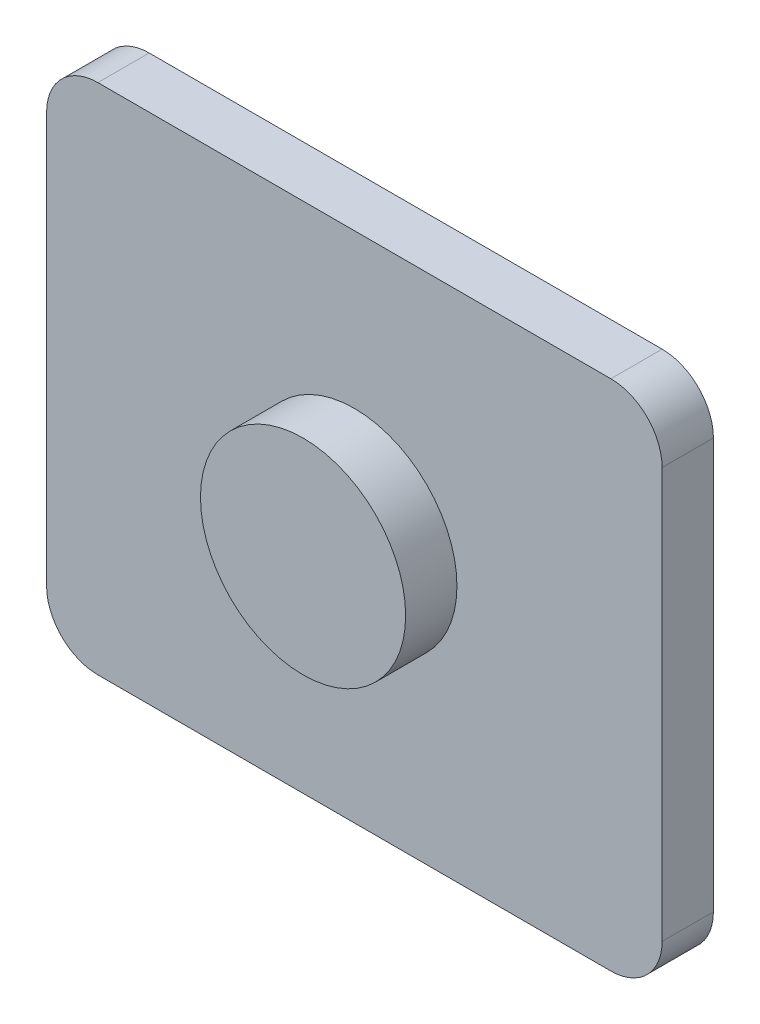
ISO-10303-21;
HEADER;
FILE_DESCRIPTION(('STEP AP214'),'2;1');
FILE_NAME('part.step','',(''),(''),'','','');
FILE_SCHEMA(('AUTOMOTIVE_DESIGN { 1 0 10303 214 1 1 1 1 }'));
ENDSEC;
DATA;
#1=APPLICATION_CONTEXT('core data for automotive mechanical design processes');
#2=APPLICATION_PROTOCOL_DEFINITION('international standard','automotive_design',2000,#1);
#3=PRODUCT_CONTEXT('',#1,'mechanical');
#4=PRODUCT('Part','Part','',(#3));
#5=PRODUCT_RELATED_PRODUCT_CATEGORY('part','',(#4));
#6=PRODUCT_DEFINITION_FORMATION('','',#4);
#7=PRODUCT_DEFINITION_CONTEXT('part definition',#1,'design');
#8=PRODUCT_DEFINITION('design','',#6,#7);
#9=PRODUCT_DEFINITION_SHAPE('','',#8);
#10=(LENGTH_UNIT() NAMED_UNIT(*) SI_UNIT(.MILLI.,.METRE.));
#11=(NAMED_UNIT(*) PLANE_ANGLE_UNIT() SI_UNIT($,.RADIAN.));
#12=(NAMED_UNIT(*) SI_UNIT($,.STERADIAN.) SOLID_ANGLE_UNIT());
#13=UNCERTAINTY_MEASURE_WITH_UNIT(LENGTH_MEASURE(1.E-05),#10,'distance_accuracy_value','');
#14=(GEOMETRIC_REPRESENTATION_CONTEXT(3) GLOBAL_UNCERTAINTY_ASSIGNED_CONTEXT((#13)) GLOBAL_UNIT_ASSIGNED_CONTEXT((#10,
#11,#12)) REPRESENTATION_CONTEXT('',''));
#15=CARTESIAN_POINT('',(0.,0.,0.));
#16=DIRECTION('',(0.,0.,1.));
#17=DIRECTION('',(1.,0.,0.));
#18=AXIS2_PLACEMENT_3D('',#15,#16,#17);
#19=CARTESIAN_POINT('',(2.,0.,2.));
#20=DIRECTION('',(0.,0.,-1.));
#21=DIRECTION('',(0.,1.,0.));
#22=AXIS2_PLACEMENT_3D('',#19,#20,#21);
#23=PLANE('',#22);
#24=CARTESIAN_POINT('',(0.,0.,2.));
#25=DIRECTION('',(0.,0.,-1.));
#26=DIRECTION('',(0.,1.,0.));
#27=AXIS2_PLACEMENT_3D('',#24,#25,#26);
#28=CIRCLE('',#27,2.);
#29=CARTESIAN_POINT('',(0.,2.,2.));
#30=VERTEX_POINT('',#29);
#31=EDGE_CURVE('E20',#30,#30,#28,.T.);
#32=ORIENTED_EDGE('',*,*,#31,.F.);
#33=EDGE_LOOP('',(#32));
#34=FACE_BOUND('',#33,.T.);
#35=ADVANCED_FACE('F17',(#34),#23,.F.);
#36=CARTESIAN_POINT('',(0.,0.,1.));
#37=DIRECTION('',(0.,0.,-1.));
#38=DIRECTION('',(0.,1.,0.));
#39=AXIS2_PLACEMENT_3D('',#36,#37,#38);
#40=CYLINDRICAL_SURFACE('',#39,2.);
#41=ORIENTED_EDGE('',*,*,#31,.T.);
#42=EDGE_LOOP('',(#41));
#43=FACE_BOUND('',#42,.T.);
#44=CARTESIAN_POINT('',(0.,0.,1.));
#45=DIRECTION('',(0.,0.,-1.));
#46=DIRECTION('',(0.,1.,0.));
#47=AXIS2_PLACEMENT_3D('',#44,#45,#46);
#48=CIRCLE('',#47,2.);
#49=CARTESIAN_POINT('',(0.,2.,1.));
#50=VERTEX_POINT('',#49);
#51=EDGE_CURVE('E90',#50,#50,#48,.F.);
#52=ORIENTED_EDGE('',*,*,#51,.T.);
#53=EDGE_LOOP('',(#52));
#54=FACE_BOUND('',#53,.T.);
#55=ADVANCED_FACE('F141',(#43,#54),#40,.T.);
#56=CARTESIAN_POINT('',(-4.99999999994,-4.999999999969,1.));
#57=DIRECTION('',(0.,0.,-1.));
#58=DIRECTION('',(-1.,0.,0.));
#59=AXIS2_PLACEMENT_3D('',#56,#57,#58);
#60=PLANE('',#59);
#61=ORIENTED_EDGE('',*,*,#51,.F.);
#62=EDGE_LOOP('',(#61));
#63=FACE_BOUND('',#62,.T.);
#64=DIRECTION('',(0.,1.,0.));
#65=VECTOR('',#64,1.);
#66=CARTESIAN_POINT('',(6.,-4.000000000026,1.));
#67=LINE('',#66,#65);
#68=CARTESIAN_POINT('',(6.,-4.000000000026,1.));
#69=VERTEX_POINT('',#68);
#70=CARTESIAN_POINT('',(6.,4.000000000018,1.));
#71=VERTEX_POINT('',#70);
#72=EDGE_CURVE('E107',#69,#71,#67,.T.);
#73=ORIENTED_EDGE('',*,*,#72,.T.);
#74=CARTESIAN_POINT('',(5.000000000026,4.000000000018,1.));
#75=DIRECTION('',(0.,0.,-1.));
#76=DIRECTION('',(0.,1.,0.));
#77=AXIS2_PLACEMENT_3D('',#74,#75,#76);
#78=CIRCLE('',#77,0.999999999974);
#79=CARTESIAN_POINT('',(5.000000000026,4.999999999992,1.));
#80=VERTEX_POINT('',#79);
#81=EDGE_CURVE('E110',#80,#71,#78,.T.);
#82=ORIENTED_EDGE('',*,*,#81,.F.);
#83=DIRECTION('',(1.,0.,0.));
#84=VECTOR('',#83,1.);
#85=CARTESIAN_POINT('',(5.000000000019,4.999999999992,1.));
#86=LINE('',#85,#84);
#87=CARTESIAN_POINT('',(-4.999999999989,4.999999999992,1.));
#88=VERTEX_POINT('',#87);
#89=EDGE_CURVE('E111',#80,#88,#86,.F.);
#90=ORIENTED_EDGE('',*,*,#89,.T.);
#91=CARTESIAN_POINT('',(-4.999999999989,4.000000000018,1.));
#92=DIRECTION('',(0.,0.,-1.));
#93=DIRECTION('',(0.,1.,0.));
#94=AXIS2_PLACEMENT_3D('',#91,#92,#93);
#95=CIRCLE('',#94,0.999999999974);
#96=CARTESIAN_POINT('',(-5.9999999999815,4.000000000025,1.));
#97=VERTEX_POINT('',#96);
#98=EDGE_CURVE('E114',#97,#88,#95,.T.);
#99=ORIENTED_EDGE('',*,*,#98,.F.);
#100=DIRECTION('',(0.,1.,0.));
#101=VECTOR('',#100,1.);
#102=CARTESIAN_POINT('',(-6.,4.00000000005,1.));
#103=LINE('',#102,#101);
#104=CARTESIAN_POINT('',(-6.,-3.999999999995,1.));
#105=VERTEX_POINT('',#104);
#106=EDGE_CURVE('E87',#97,#105,#103,.F.);
#107=ORIENTED_EDGE('',*,*,#106,.T.);
#108=CARTESIAN_POINT('',(-5.000000000026,-3.999999999995,1.));
#109=DIRECTION('',(0.,0.,-1.));
#110=DIRECTION('',(0.,1.,0.));
#111=AXIS2_PLACEMENT_3D('',#108,#109,#110);
#112=CIRCLE('',#111,0.999999999974);
#113=CARTESIAN_POINT('',(-4.999999999983,-4.999999999969,1.));
#114=VERTEX_POINT('',#113);
#115=EDGE_CURVE('E80',#114,#105,#112,.T.);
#116=ORIENTED_EDGE('',*,*,#115,.F.);
#117=DIRECTION('',(1.,0.,0.));
#118=VECTOR('',#117,1.);
#119=CARTESIAN_POINT('',(-4.99999999994,-4.999999999969,1.));
#120=LINE('',#119,#118);
#121=CARTESIAN_POINT('',(5.000000000026,-4.999999999969,1.));
#122=VERTEX_POINT('',#121);
#123=EDGE_CURVE('E85',#114,#122,#120,.T.);
#124=ORIENTED_EDGE('',*,*,#123,.T.);
#125=CARTESIAN_POINT('',(5.000000000026,-4.000000000026,1.));
#126=DIRECTION('',(0.,0.,-1.));
#127=DIRECTION('',(0.,1.,0.));
#128=AXIS2_PLACEMENT_3D('',#125,#126,#127);
#129=CIRCLE('',#128,0.999999999974);
#130=EDGE_CURVE('E98',#69,#122,#129,.T.);
#131=ORIENTED_EDGE('',*,*,#130,.F.);
#132=EDGE_LOOP('',(#73,#82,#90,#99,#107,#116,#124,#131));
#133=FACE_BOUND('',#132,.T.);
#134=ADVANCED_FACE('F82',(#63,#133),#60,.F.);
#135=CARTESIAN_POINT('',(-5.000000000026,-3.999999999995,0.));
#136=DIRECTION('',(0.,0.,-1.));
#137=DIRECTION('',(0.,1.,0.));
#138=AXIS2_PLACEMENT_3D('',#135,#136,#137);
#139=CYLINDRICAL_SURFACE('',#138,0.999999999974);
#140=ORIENTED_EDGE('',*,*,#115,.T.);
#141=DIRECTION('',(0.,0.,-1.));
#142=VECTOR('',#141,1.);
#143=CARTESIAN_POINT('',(-6.,-3.999999999995,0.));
#144=LINE('',#143,#142);
#145=CARTESIAN_POINT('',(-6.,-3.999999999995,0.));
#146=VERTEX_POINT('',#145);
#147=EDGE_CURVE('E105',#105,#146,#144,.T.);
#148=ORIENTED_EDGE('',*,*,#147,.T.);
#149=CARTESIAN_POINT('',(-5.000000000026,-3.999999999995,0.));
#150=DIRECTION('',(0.,0.,-1.));
#151=DIRECTION('',(0.,1.,0.));
#152=AXIS2_PLACEMENT_3D('',#149,#150,#151);
#153=CIRCLE('',#152,0.999999999974);
#154=CARTESIAN_POINT('',(-4.999999999983,-4.9999999999765,0.));
#155=VERTEX_POINT('',#154);
#156=EDGE_CURVE('E96',#155,#146,#153,.T.);
#157=ORIENTED_EDGE('',*,*,#156,.F.);
#158=DIRECTION('',(0.,0.,1.));
#159=VECTOR('',#158,1.);
#160=CARTESIAN_POINT('',(-4.99999999994,-4.999999999969,0.));
#161=LINE('',#160,#159);
#162=EDGE_CURVE('E93',#155,#114,#161,.T.);
#163=ORIENTED_EDGE('',*,*,#162,.T.);
#164=EDGE_LOOP('',(#140,#148,#157,#163));
#165=FACE_BOUND('',#164,.T.);
#166=ADVANCED_FACE('F94',(#165),#139,.T.);
#167=CARTESIAN_POINT('',(-6.,4.00000000005,0.));
#168=DIRECTION('',(1.,0.,0.));
#169=DIRECTION('',(0.,0.,-1.));
#170=AXIS2_PLACEMENT_3D('',#167,#168,#169);
#171=PLANE('',#170);
#172=ORIENTED_EDGE('',*,*,#147,.F.);
#173=ORIENTED_EDGE('',*,*,#106,.F.);
#174=DIRECTION('',(0.,0.,-1.));
#175=VECTOR('',#174,1.);
#176=CARTESIAN_POINT('',(-5.999999999963,4.000000000032,0.));
#177=LINE('',#176,#175);
#178=CARTESIAN_POINT('',(-5.9999999999815,4.000000000025,0.));
#179=VERTEX_POINT('',#178);
#180=EDGE_CURVE('E134',#179,#97,#177,.F.);
#181=ORIENTED_EDGE('',*,*,#180,.F.);
#182=DIRECTION('',(0.,1.,0.));
#183=VECTOR('',#182,1.);
#184=CARTESIAN_POINT('',(-6.,-4.999999999969,0.));
#185=LINE('',#184,#183);
#186=EDGE_CURVE('E126',#146,#179,#185,.T.);
#187=ORIENTED_EDGE('',*,*,#186,.F.);
#188=EDGE_LOOP('',(#172,#173,#181,#187));
#189=FACE_BOUND('',#188,.T.);
#190=ADVANCED_FACE('F175',(#189),#171,.F.);
#191=CARTESIAN_POINT('',(-4.999999999989,4.000000000018,0.));
#192=DIRECTION('',(0.,0.,-1.));
#193=DIRECTION('',(0.,1.,0.));
#194=AXIS2_PLACEMENT_3D('',#191,#192,#193);
#195=CYLINDRICAL_SURFACE('',#194,0.999999999974);
#196=ORIENTED_EDGE('',*,*,#98,.T.);
#197=DIRECTION('',(0.,0.,-1.));
#198=VECTOR('',#197,1.);
#199=CARTESIAN_POINT('',(-4.999999999989,4.999999999992,0.));
#200=LINE('',#199,#198);
#201=CARTESIAN_POINT('',(-4.999999999989,4.999999999992,0.));
#202=VERTEX_POINT('',#201);
#203=EDGE_CURVE('E113',#88,#202,#200,.T.);
#204=ORIENTED_EDGE('',*,*,#203,.T.);
#205=CARTESIAN_POINT('',(-4.999999999989,4.000000000018,0.));
#206=DIRECTION('',(0.,0.,-1.));
#207=DIRECTION('',(0.,1.,0.));
#208=AXIS2_PLACEMENT_3D('',#205,#206,#207);
#209=CIRCLE('',#208,0.999999999974);
#210=EDGE_CURVE('E123',#179,#202,#209,.T.);
#211=ORIENTED_EDGE('',*,*,#210,.F.);
#212=ORIENTED_EDGE('',*,*,#180,.T.);
#213=EDGE_LOOP('',(#196,#204,#211,#212));
#214=FACE_BOUND('',#213,.T.);
#215=ADVANCED_FACE('F171',(#214),#195,.T.);
#216=CARTESIAN_POINT('',(5.000000000019,4.999999999992,0.));
#217=DIRECTION('',(0.,-1.,0.));
#218=DIRECTION('',(0.,0.,-1.));
#219=AXIS2_PLACEMENT_3D('',#216,#217,#218);
#220=PLANE('',#219);
#221=ORIENTED_EDGE('',*,*,#203,.F.);
#222=ORIENTED_EDGE('',*,*,#89,.F.);
#223=DIRECTION('',(0.,0.,-1.));
#224=VECTOR('',#223,1.);
#225=CARTESIAN_POINT('',(5.000000000026,4.999999999992,0.));
#226=LINE('',#225,#224);
#227=CARTESIAN_POINT('',(5.000000000026,4.999999999992,0.));
#228=VERTEX_POINT('',#227);
#229=EDGE_CURVE('E132',#228,#80,#226,.F.);
#230=ORIENTED_EDGE('',*,*,#229,.F.);
#231=DIRECTION('',(-1.,0.,0.));
#232=VECTOR('',#231,1.);
#233=CARTESIAN_POINT('',(-4.99999999994,4.999999999992,0.));
#234=LINE('',#233,#232);
#235=EDGE_CURVE('E122',#202,#228,#234,.F.);
#236=ORIENTED_EDGE('',*,*,#235,.F.);
#237=EDGE_LOOP('',(#221,#222,#230,#236));
#238=FACE_BOUND('',#237,.T.);
#239=ADVANCED_FACE('F167',(#238),#220,.F.);
#240=CARTESIAN_POINT('',(5.000000000026,4.000000000018,0.));
#241=DIRECTION('',(0.,0.,-1.));
#242=DIRECTION('',(0.,1.,0.));
#243=AXIS2_PLACEMENT_3D('',#240,#241,#242);
#244=CYLINDRICAL_SURFACE('',#243,0.999999999974);
#245=ORIENTED_EDGE('',*,*,#81,.T.);
#246=DIRECTION('',(0.,0.,1.));
#247=VECTOR('',#246,1.);
#248=CARTESIAN_POINT('',(6.,4.000000000018,0.));
#249=LINE('',#248,#247);
#250=CARTESIAN_POINT('',(6.,4.000000000018,0.));
#251=VERTEX_POINT('',#250);
#252=EDGE_CURVE('E109',#71,#251,#249,.F.);
#253=ORIENTED_EDGE('',*,*,#252,.T.);
#254=CARTESIAN_POINT('',(5.000000000026,4.000000000018,0.));
#255=DIRECTION('',(0.,0.,-1.));
#256=DIRECTION('',(0.,1.,0.));
#257=AXIS2_PLACEMENT_3D('',#254,#255,#256);
#258=CIRCLE('',#257,0.999999999974);
#259=EDGE_CURVE('E119',#228,#251,#258,.T.);
#260=ORIENTED_EDGE('',*,*,#259,.F.);
#261=ORIENTED_EDGE('',*,*,#229,.T.);
#262=EDGE_LOOP('',(#245,#253,#260,#261));
#263=FACE_BOUND('',#262,.T.);
#264=ADVANCED_FACE('F163',(#263),#244,.T.);
#265=CARTESIAN_POINT('',(6.,-4.000000000026,0.));
#266=DIRECTION('',(-1.,0.,0.));
#267=DIRECTION('',(0.,0.,1.));
#268=AXIS2_PLACEMENT_3D('',#265,#266,#267);
#269=PLANE('',#268);
#270=ORIENTED_EDGE('',*,*,#252,.F.);
#271=ORIENTED_EDGE('',*,*,#72,.F.);
#272=DIRECTION('',(0.,0.,-1.));
#273=VECTOR('',#272,1.);
#274=CARTESIAN_POINT('',(6.,-4.000000000026,0.));
#275=LINE('',#274,#273);
#276=CARTESIAN_POINT('',(6.,-4.000000000026,0.));
#277=VERTEX_POINT('',#276);
#278=EDGE_CURVE('E129',#277,#69,#275,.F.);
#279=ORIENTED_EDGE('',*,*,#278,.F.);
#280=DIRECTION('',(0.,1.,0.));
#281=VECTOR('',#280,1.);
#282=CARTESIAN_POINT('',(6.,-4.999999999969,0.));
#283=LINE('',#282,#281);
#284=EDGE_CURVE('E118',#251,#277,#283,.F.);
#285=ORIENTED_EDGE('',*,*,#284,.F.);
#286=EDGE_LOOP('',(#270,#271,#279,#285));
#287=FACE_BOUND('',#286,.T.);
#288=ADVANCED_FACE('F160',(#287),#269,.F.);
#289=CARTESIAN_POINT('',(5.000000000026,-4.000000000026,0.));
#290=DIRECTION('',(0.,0.,-1.));
#291=DIRECTION('',(0.,1.,0.));
#292=AXIS2_PLACEMENT_3D('',#289,#290,#291);
#293=CYLINDRICAL_SURFACE('',#292,0.999999999974);
#294=ORIENTED_EDGE('',*,*,#130,.T.);
#295=DIRECTION('',(0.,0.,1.));
#296=VECTOR('',#295,1.);
#297=CARTESIAN_POINT('',(5.000000000026,-4.999999999969,0.));
#298=LINE('',#297,#296);
#299=CARTESIAN_POINT('',(5.000000000026,-4.9999999999765,0.));
#300=VERTEX_POINT('',#299);
#301=EDGE_CURVE('E35',#122,#300,#298,.F.);
#302=ORIENTED_EDGE('',*,*,#301,.T.);
#303=CARTESIAN_POINT('',(5.000000000026,-4.000000000026,0.));
#304=DIRECTION('',(0.,0.,-1.));
#305=DIRECTION('',(0.,1.,0.));
#306=AXIS2_PLACEMENT_3D('',#303,#304,#305);
#307=CIRCLE('',#306,0.999999999974);
#308=EDGE_CURVE('E26',#277,#300,#307,.T.);
#309=ORIENTED_EDGE('',*,*,#308,.F.);
#310=ORIENTED_EDGE('',*,*,#278,.T.);
#311=EDGE_LOOP('',(#294,#302,#309,#310));
#312=FACE_BOUND('',#311,.T.);
#313=ADVANCED_FACE('F155',(#312),#293,.T.);
#314=CARTESIAN_POINT('',(-4.99999999994,-4.999999999969,0.));
#315=DIRECTION('',(0.,1.,0.));
#316=DIRECTION('',(0.,0.,1.));
#317=AXIS2_PLACEMENT_3D('',#314,#315,#316);
#318=PLANE('',#317);
#319=ORIENTED_EDGE('',*,*,#301,.F.);
#320=ORIENTED_EDGE('',*,*,#123,.F.);
#321=ORIENTED_EDGE('',*,*,#162,.F.);
#322=DIRECTION('',(-1.,0.,0.));
#323=VECTOR('',#322,1.);
#324=CARTESIAN_POINT('',(-4.99999999994,-4.999999999984,0.));
#325=LINE('',#324,#323);
#326=EDGE_CURVE('E11',#300,#155,#325,.T.);
#327=ORIENTED_EDGE('',*,*,#326,.F.);
#328=EDGE_LOOP('',(#319,#320,#321,#327));
#329=FACE_BOUND('',#328,.T.);
#330=ADVANCED_FACE('F100',(#329),#318,.F.);
#331=CARTESIAN_POINT('',(-4.99999999994,-4.999999999969,0.));
#332=DIRECTION('',(0.,0.,-1.));
#333=DIRECTION('',(-1.,0.,0.));
#334=AXIS2_PLACEMENT_3D('',#331,#332,#333);
#335=PLANE('',#334);
#336=ORIENTED_EDGE('',*,*,#308,.T.);
#337=ORIENTED_EDGE('',*,*,#326,.T.);
#338=ORIENTED_EDGE('',*,*,#156,.T.);
#339=ORIENTED_EDGE('',*,*,#186,.T.);
#340=ORIENTED_EDGE('',*,*,#210,.T.);
#341=ORIENTED_EDGE('',*,*,#235,.T.);
#342=ORIENTED_EDGE('',*,*,#259,.T.);
#343=ORIENTED_EDGE('',*,*,#284,.T.);
#344=EDGE_LOOP('',(#336,#337,#338,#339,#340,#341,#342,#343));
#345=FACE_BOUND('',#344,.T.);
#346=ADVANCED_FACE('F148',(#345),#335,.T.);
#347=CLOSED_SHELL('',(#35,#55,#134,#166,#190,#215,#239,#264,#288,#313,#330,#346));
#348=MANIFOLD_SOLID_BREP('B1',#347);
#349=ADVANCED_BREP_SHAPE_REPRESENTATION('',(#18,#348),#14);
#350=SHAPE_DEFINITION_REPRESENTATION(#9,#349);
ENDSEC;
END-ISO-10303-21;
